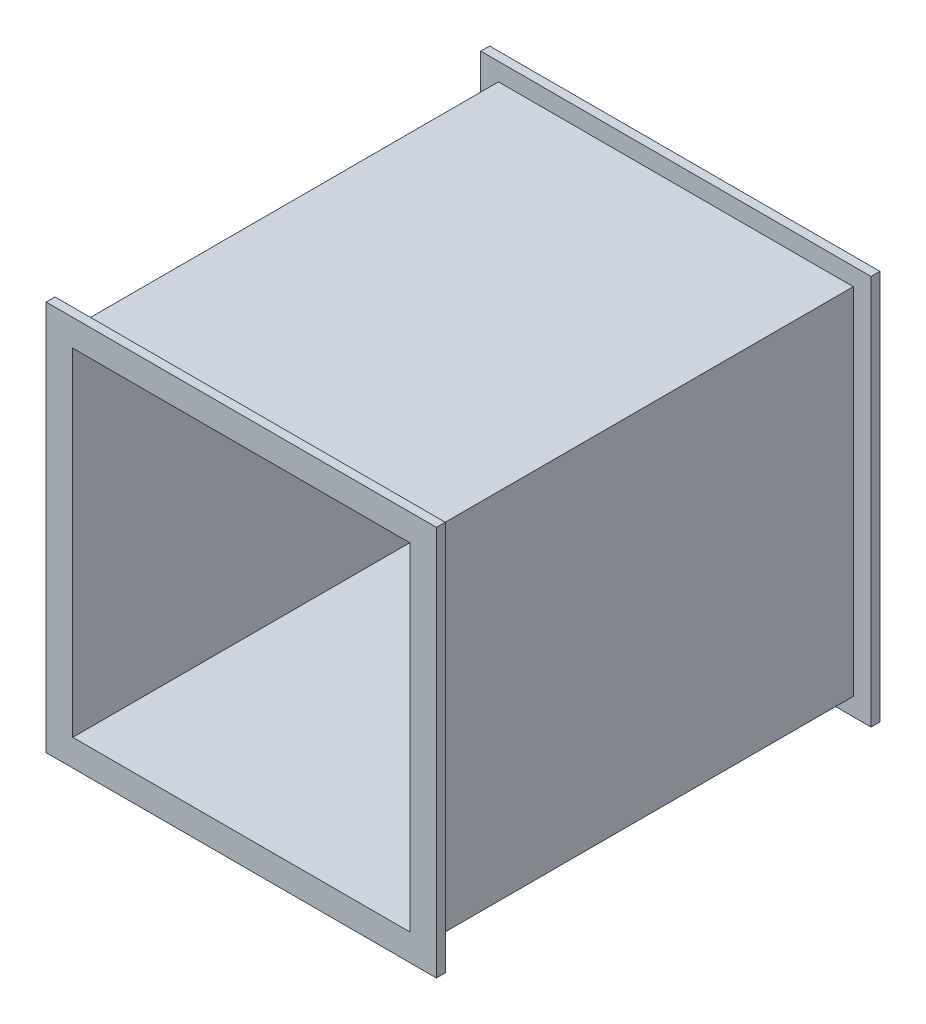
ISO-10303-21;
HEADER;
FILE_DESCRIPTION(('STEP AP214'),'2;1');
FILE_NAME('part.step','',(''),(''),'','','');
FILE_SCHEMA(('AUTOMOTIVE_DESIGN { 1 0 10303 214 1 1 1 1 }'));
ENDSEC;
DATA;
#1=APPLICATION_CONTEXT('core data for automotive mechanical design processes');
#2=APPLICATION_PROTOCOL_DEFINITION('international standard','automotive_design',2000,#1);
#3=PRODUCT_CONTEXT('',#1,'mechanical');
#4=PRODUCT('Part','Part','',(#3));
#5=PRODUCT_RELATED_PRODUCT_CATEGORY('part','',(#4));
#6=PRODUCT_DEFINITION_FORMATION('','',#4);
#7=PRODUCT_DEFINITION_CONTEXT('part definition',#1,'design');
#8=PRODUCT_DEFINITION('design','',#6,#7);
#9=PRODUCT_DEFINITION_SHAPE('','',#8);
#10=(LENGTH_UNIT() NAMED_UNIT(*) SI_UNIT(.MILLI.,.METRE.));
#11=(NAMED_UNIT(*) PLANE_ANGLE_UNIT() SI_UNIT($,.RADIAN.));
#12=(NAMED_UNIT(*) SI_UNIT($,.STERADIAN.) SOLID_ANGLE_UNIT());
#13=UNCERTAINTY_MEASURE_WITH_UNIT(LENGTH_MEASURE(1.E-05),#10,'distance_accuracy_value','');
#14=(GEOMETRIC_REPRESENTATION_CONTEXT(3) GLOBAL_UNCERTAINTY_ASSIGNED_CONTEXT((#13)) GLOBAL_UNIT_ASSIGNED_CONTEXT((#10,
#11,#12)) REPRESENTATION_CONTEXT('',''));
#15=CARTESIAN_POINT('',(0.,0.,0.));
#16=DIRECTION('',(0.,0.,1.));
#17=DIRECTION('',(1.,0.,0.));
#18=AXIS2_PLACEMENT_3D('',#15,#16,#17);
#19=CARTESIAN_POINT('',(100.,100.,250.));
#20=DIRECTION('',(-1.,0.,0.));
#21=DIRECTION('',(0.,-1.,0.));
#22=AXIS2_PLACEMENT_3D('',#19,#20,#21);
#23=PLANE('',#22);
#24=DIRECTION('',(0.,-1.,0.));
#25=VECTOR('',#24,1.);
#26=CARTESIAN_POINT('',(100.,100.,5.));
#27=LINE('',#26,#25);
#28=CARTESIAN_POINT('',(100.,100.,5.));
#29=VERTEX_POINT('',#28);
#30=CARTESIAN_POINT('',(100.,-99.9999999999999,5.));
#31=VERTEX_POINT('',#30);
#32=EDGE_CURVE('E222',#29,#31,#27,.T.);
#33=ORIENTED_EDGE('',*,*,#32,.F.);
#34=DIRECTION('',(0.,0.,-1.));
#35=VECTOR('',#34,1.);
#36=CARTESIAN_POINT('',(100.,100.,250.));
#37=LINE('',#36,#35);
#38=CARTESIAN_POINT('',(100.,100.,245.));
#39=VERTEX_POINT('',#38);
#40=EDGE_CURVE('E274',#39,#29,#37,.T.);
#41=ORIENTED_EDGE('',*,*,#40,.F.);
#42=DIRECTION('',(0.,1.,0.));
#43=VECTOR('',#42,1.);
#44=CARTESIAN_POINT('',(100.,100.,245.));
#45=LINE('',#44,#43);
#46=CARTESIAN_POINT('',(100.,-99.9999999999999,245.));
#47=VERTEX_POINT('',#46);
#48=EDGE_CURVE('E263',#47,#39,#45,.T.);
#49=ORIENTED_EDGE('',*,*,#48,.F.);
#50=DIRECTION('',(0.,0.,-1.));
#51=VECTOR('',#50,1.);
#52=CARTESIAN_POINT('',(100.,-99.9999999999999,250.));
#53=LINE('',#52,#51);
#54=EDGE_CURVE('E266',#47,#31,#53,.T.);
#55=ORIENTED_EDGE('',*,*,#54,.T.);
#56=EDGE_LOOP('',(#33,#41,#49,#55));
#57=FACE_BOUND('',#56,.T.);
#58=ADVANCED_FACE('F36',(#57),#23,.F.);
#59=CARTESIAN_POINT('',(-100.,100.,250.));
#60=DIRECTION('',(0.,-1.,0.));
#61=DIRECTION('',(0.,0.,-1.));
#62=AXIS2_PLACEMENT_3D('',#59,#60,#61);
#63=PLANE('',#62);
#64=DIRECTION('',(1.,0.,0.));
#65=VECTOR('',#64,1.);
#66=CARTESIAN_POINT('',(-100.,100.,5.));
#67=LINE('',#66,#65);
#68=CARTESIAN_POINT('',(-100.,100.,5.));
#69=VERTEX_POINT('',#68);
#70=EDGE_CURVE('E219',#69,#29,#67,.T.);
#71=ORIENTED_EDGE('',*,*,#70,.F.);
#72=DIRECTION('',(0.,0.,-1.));
#73=VECTOR('',#72,1.);
#74=CARTESIAN_POINT('',(-100.,100.,250.));
#75=LINE('',#74,#73);
#76=CARTESIAN_POINT('',(-100.,100.,245.));
#77=VERTEX_POINT('',#76);
#78=EDGE_CURVE('E271',#77,#69,#75,.T.);
#79=ORIENTED_EDGE('',*,*,#78,.F.);
#80=DIRECTION('',(-1.,0.,0.));
#81=VECTOR('',#80,1.);
#82=CARTESIAN_POINT('',(-100.,100.,245.));
#83=LINE('',#82,#81);
#84=EDGE_CURVE('E260',#39,#77,#83,.T.);
#85=ORIENTED_EDGE('',*,*,#84,.F.);
#86=ORIENTED_EDGE('',*,*,#40,.T.);
#87=EDGE_LOOP('',(#71,#79,#85,#86));
#88=FACE_BOUND('',#87,.T.);
#89=ADVANCED_FACE('F292',(#88),#63,.F.);
#90=CARTESIAN_POINT('',(-100.,100.,250.));
#91=DIRECTION('',(1.,0.,0.));
#92=DIRECTION('',(0.,1.,0.));
#93=AXIS2_PLACEMENT_3D('',#90,#91,#92);
#94=PLANE('',#93);
#95=DIRECTION('',(0.,1.,0.));
#96=VECTOR('',#95,1.);
#97=CARTESIAN_POINT('',(-100.,100.,5.));
#98=LINE('',#97,#96);
#99=CARTESIAN_POINT('',(-100.,-99.9999999999999,5.));
#100=VERTEX_POINT('',#99);
#101=EDGE_CURVE('E211',#100,#69,#98,.T.);
#102=ORIENTED_EDGE('',*,*,#101,.F.);
#103=DIRECTION('',(0.,0.,-1.));
#104=VECTOR('',#103,1.);
#105=CARTESIAN_POINT('',(-100.,-99.9999999999999,250.));
#106=LINE('',#105,#104);
#107=CARTESIAN_POINT('',(-100.,-99.9999999999999,245.));
#108=VERTEX_POINT('',#107);
#109=EDGE_CURVE('E269',#108,#100,#106,.T.);
#110=ORIENTED_EDGE('',*,*,#109,.F.);
#111=DIRECTION('',(0.,-1.,0.));
#112=VECTOR('',#111,1.);
#113=CARTESIAN_POINT('',(-100.,100.,245.));
#114=LINE('',#113,#112);
#115=EDGE_CURVE('E252',#77,#108,#114,.T.);
#116=ORIENTED_EDGE('',*,*,#115,.F.);
#117=ORIENTED_EDGE('',*,*,#78,.T.);
#118=EDGE_LOOP('',(#102,#110,#116,#117));
#119=FACE_BOUND('',#118,.T.);
#120=ADVANCED_FACE('F285',(#119),#94,.F.);
#121=CARTESIAN_POINT('',(-100.,-99.9999999999999,250.));
#122=DIRECTION('',(0.,1.,0.));
#123=DIRECTION('',(0.,0.,1.));
#124=AXIS2_PLACEMENT_3D('',#121,#122,#123);
#125=PLANE('',#124);
#126=DIRECTION('',(-1.,0.,0.));
#127=VECTOR('',#126,1.);
#128=CARTESIAN_POINT('',(-100.,-99.9999999999999,5.));
#129=LINE('',#128,#127);
#130=EDGE_CURVE('E11',#31,#100,#129,.T.);
#131=ORIENTED_EDGE('',*,*,#130,.F.);
#132=ORIENTED_EDGE('',*,*,#54,.F.);
#133=DIRECTION('',(1.,0.,0.));
#134=VECTOR('',#133,1.);
#135=CARTESIAN_POINT('',(-100.,-99.9999999999999,245.));
#136=LINE('',#135,#134);
#137=EDGE_CURVE('E43',#108,#47,#136,.T.);
#138=ORIENTED_EDGE('',*,*,#137,.F.);
#139=ORIENTED_EDGE('',*,*,#109,.T.);
#140=EDGE_LOOP('',(#131,#132,#138,#139));
#141=FACE_BOUND('',#140,.T.);
#142=ADVANCED_FACE('F282',(#141),#125,.F.);
#143=CARTESIAN_POINT('',(0.,0.,245.));
#144=DIRECTION('',(0.,0.,1.));
#145=DIRECTION('',(1.,0.,0.));
#146=AXIS2_PLACEMENT_3D('',#143,#144,#145);
#147=PLANE('',#146);
#148=DIRECTION('',(0.,1.,0.));
#149=VECTOR('',#148,1.);
#150=CARTESIAN_POINT('',(110.,-110.,245.));
#151=LINE('',#150,#149);
#152=CARTESIAN_POINT('',(110.,-110.,245.));
#153=VERTEX_POINT('',#152);
#154=CARTESIAN_POINT('',(110.,110.,245.));
#155=VERTEX_POINT('',#154);
#156=EDGE_CURVE('E226',#153,#155,#151,.T.);
#157=ORIENTED_EDGE('',*,*,#156,.F.);
#158=DIRECTION('',(1.,0.,0.));
#159=VECTOR('',#158,1.);
#160=CARTESIAN_POINT('',(-110.,-110.,245.));
#161=LINE('',#160,#159);
#162=CARTESIAN_POINT('',(-110.,-110.,245.));
#163=VERTEX_POINT('',#162);
#164=EDGE_CURVE('E236',#163,#153,#161,.T.);
#165=ORIENTED_EDGE('',*,*,#164,.F.);
#166=DIRECTION('',(0.,-1.,0.));
#167=VECTOR('',#166,1.);
#168=CARTESIAN_POINT('',(-110.,110.,245.));
#169=LINE('',#168,#167);
#170=CARTESIAN_POINT('',(-110.,110.,245.));
#171=VERTEX_POINT('',#170);
#172=EDGE_CURVE('E233',#171,#163,#169,.T.);
#173=ORIENTED_EDGE('',*,*,#172,.F.);
#174=DIRECTION('',(-1.,0.,0.));
#175=VECTOR('',#174,1.);
#176=CARTESIAN_POINT('',(110.,110.,245.));
#177=LINE('',#176,#175);
#178=EDGE_CURVE('E229',#155,#171,#177,.T.);
#179=ORIENTED_EDGE('',*,*,#178,.F.);
#180=EDGE_LOOP('',(#157,#165,#173,#179));
#181=FACE_BOUND('',#180,.T.);
#182=ORIENTED_EDGE('',*,*,#137,.T.);
#183=ORIENTED_EDGE('',*,*,#48,.T.);
#184=ORIENTED_EDGE('',*,*,#84,.T.);
#185=ORIENTED_EDGE('',*,*,#115,.T.);
#186=EDGE_LOOP('',(#182,#183,#184,#185));
#187=FACE_BOUND('',#186,.T.);
#188=ADVANCED_FACE('F278',(#181,#187),#147,.F.);
#189=CARTESIAN_POINT('',(110.,-110.,245.));
#190=DIRECTION('',(1.,0.,0.));
#191=DIRECTION('',(0.,1.,0.));
#192=AXIS2_PLACEMENT_3D('',#189,#190,#191);
#193=PLANE('',#192);
#194=DIRECTION('',(0.,1.,0.));
#195=VECTOR('',#194,1.);
#196=CARTESIAN_POINT('',(110.,-110.,250.));
#197=LINE('',#196,#195);
#198=CARTESIAN_POINT('',(110.,-110.,250.));
#199=VERTEX_POINT('',#198);
#200=CARTESIAN_POINT('',(110.,110.,250.));
#201=VERTEX_POINT('',#200);
#202=EDGE_CURVE('E225',#199,#201,#197,.T.);
#203=ORIENTED_EDGE('',*,*,#202,.F.);
#204=DIRECTION('',(0.,0.,1.));
#205=VECTOR('',#204,1.);
#206=CARTESIAN_POINT('',(110.,-110.,245.));
#207=LINE('',#206,#205);
#208=EDGE_CURVE('E250',#153,#199,#207,.T.);
#209=ORIENTED_EDGE('',*,*,#208,.F.);
#210=ORIENTED_EDGE('',*,*,#156,.T.);
#211=DIRECTION('',(0.,0.,1.));
#212=VECTOR('',#211,1.);
#213=CARTESIAN_POINT('',(110.,110.,245.));
#214=LINE('',#213,#212);
#215=EDGE_CURVE('E239',#155,#201,#214,.T.);
#216=ORIENTED_EDGE('',*,*,#215,.T.);
#217=EDGE_LOOP('',(#203,#209,#210,#216));
#218=FACE_BOUND('',#217,.T.);
#219=ADVANCED_FACE('F310',(#218),#193,.T.);
#220=CARTESIAN_POINT('',(-110.,-110.,245.));
#221=DIRECTION('',(0.,-1.,0.));
#222=DIRECTION('',(0.,0.,-1.));
#223=AXIS2_PLACEMENT_3D('',#220,#221,#222);
#224=PLANE('',#223);
#225=DIRECTION('',(1.,0.,0.));
#226=VECTOR('',#225,1.);
#227=CARTESIAN_POINT('',(-110.,-110.,250.));
#228=LINE('',#227,#226);
#229=CARTESIAN_POINT('',(-110.,-110.,250.));
#230=VERTEX_POINT('',#229);
#231=EDGE_CURVE('E230',#230,#199,#228,.T.);
#232=ORIENTED_EDGE('',*,*,#231,.F.);
#233=DIRECTION('',(0.,0.,1.));
#234=VECTOR('',#233,1.);
#235=CARTESIAN_POINT('',(-110.,-110.,245.));
#236=LINE('',#235,#234);
#237=EDGE_CURVE('E253',#163,#230,#236,.T.);
#238=ORIENTED_EDGE('',*,*,#237,.F.);
#239=ORIENTED_EDGE('',*,*,#164,.T.);
#240=ORIENTED_EDGE('',*,*,#208,.T.);
#241=EDGE_LOOP('',(#232,#238,#239,#240));
#242=FACE_BOUND('',#241,.T.);
#243=ADVANCED_FACE('F313',(#242),#224,.T.);
#244=CARTESIAN_POINT('',(-110.,110.,245.));
#245=DIRECTION('',(-1.,0.,0.));
#246=DIRECTION('',(0.,-1.,0.));
#247=AXIS2_PLACEMENT_3D('',#244,#245,#246);
#248=PLANE('',#247);
#249=DIRECTION('',(0.,-1.,0.));
#250=VECTOR('',#249,1.);
#251=CARTESIAN_POINT('',(-110.,110.,250.));
#252=LINE('',#251,#250);
#253=CARTESIAN_POINT('',(-110.,110.,250.));
#254=VERTEX_POINT('',#253);
#255=EDGE_CURVE('E245',#254,#230,#252,.T.);
#256=ORIENTED_EDGE('',*,*,#255,.F.);
#257=DIRECTION('',(0.,0.,1.));
#258=VECTOR('',#257,1.);
#259=CARTESIAN_POINT('',(-110.,110.,245.));
#260=LINE('',#259,#258);
#261=EDGE_CURVE('E255',#171,#254,#260,.T.);
#262=ORIENTED_EDGE('',*,*,#261,.F.);
#263=ORIENTED_EDGE('',*,*,#172,.T.);
#264=ORIENTED_EDGE('',*,*,#237,.T.);
#265=EDGE_LOOP('',(#256,#262,#263,#264));
#266=FACE_BOUND('',#265,.T.);
#267=ADVANCED_FACE('F317',(#266),#248,.T.);
#268=CARTESIAN_POINT('',(110.,110.,245.));
#269=DIRECTION('',(0.,1.,0.));
#270=DIRECTION('',(0.,0.,1.));
#271=AXIS2_PLACEMENT_3D('',#268,#269,#270);
#272=PLANE('',#271);
#273=DIRECTION('',(-1.,0.,0.));
#274=VECTOR('',#273,1.);
#275=CARTESIAN_POINT('',(110.,110.,250.));
#276=LINE('',#275,#274);
#277=EDGE_CURVE('E242',#201,#254,#276,.T.);
#278=ORIENTED_EDGE('',*,*,#277,.F.);
#279=ORIENTED_EDGE('',*,*,#215,.F.);
#280=ORIENTED_EDGE('',*,*,#178,.T.);
#281=ORIENTED_EDGE('',*,*,#261,.T.);
#282=EDGE_LOOP('',(#278,#279,#280,#281));
#283=FACE_BOUND('',#282,.T.);
#284=ADVANCED_FACE('F308',(#283),#272,.T.);
#285=CARTESIAN_POINT('',(0.,0.,250.));
#286=DIRECTION('',(0.,0.,1.));
#287=DIRECTION('',(1.,0.,0.));
#288=AXIS2_PLACEMENT_3D('',#285,#286,#287);
#289=PLANE('',#288);
#290=DIRECTION('',(0.,1.,0.));
#291=VECTOR('',#290,1.);
#292=CARTESIAN_POINT('',(95.,-95.,250.));
#293=LINE('',#292,#291);
#294=CARTESIAN_POINT('',(95.,-95.,250.));
#295=VERTEX_POINT('',#294);
#296=CARTESIAN_POINT('',(95.,95.,250.));
#297=VERTEX_POINT('',#296);
#298=EDGE_CURVE('E50',#295,#297,#293,.T.);
#299=ORIENTED_EDGE('',*,*,#298,.F.);
#300=DIRECTION('',(1.,0.,0.));
#301=VECTOR('',#300,1.);
#302=CARTESIAN_POINT('',(-95.,-95.,250.));
#303=LINE('',#302,#301);
#304=CARTESIAN_POINT('',(-95.,-95.,250.));
#305=VERTEX_POINT('',#304);
#306=EDGE_CURVE('E166',#305,#295,#303,.T.);
#307=ORIENTED_EDGE('',*,*,#306,.F.);
#308=DIRECTION('',(0.,-1.,0.));
#309=VECTOR('',#308,1.);
#310=CARTESIAN_POINT('',(-95.,-95.,250.));
#311=LINE('',#310,#309);
#312=CARTESIAN_POINT('',(-95.,95.,250.));
#313=VERTEX_POINT('',#312);
#314=EDGE_CURVE('E169',#313,#305,#311,.T.);
#315=ORIENTED_EDGE('',*,*,#314,.F.);
#316=DIRECTION('',(-1.,0.,0.));
#317=VECTOR('',#316,1.);
#318=CARTESIAN_POINT('',(-95.,95.,250.));
#319=LINE('',#318,#317);
#320=EDGE_CURVE('E175',#297,#313,#319,.T.);
#321=ORIENTED_EDGE('',*,*,#320,.F.);
#322=EDGE_LOOP('',(#299,#307,#315,#321));
#323=FACE_BOUND('',#322,.T.);
#324=ORIENTED_EDGE('',*,*,#202,.T.);
#325=ORIENTED_EDGE('',*,*,#277,.T.);
#326=ORIENTED_EDGE('',*,*,#255,.T.);
#327=ORIENTED_EDGE('',*,*,#231,.T.);
#328=EDGE_LOOP('',(#324,#325,#326,#327));
#329=FACE_BOUND('',#328,.T.);
#330=ADVANCED_FACE('F305',(#323,#329),#289,.T.);
#331=CARTESIAN_POINT('',(0.,0.,5.));
#332=DIRECTION('',(0.,0.,-1.));
#333=DIRECTION('',(-1.,0.,0.));
#334=AXIS2_PLACEMENT_3D('',#331,#332,#333);
#335=PLANE('',#334);
#336=DIRECTION('',(1.,0.,0.));
#337=VECTOR('',#336,1.);
#338=CARTESIAN_POINT('',(-110.,110.,5.));
#339=LINE('',#338,#337);
#340=CARTESIAN_POINT('',(-110.,110.,5.));
#341=VERTEX_POINT('',#340);
#342=CARTESIAN_POINT('',(110.,110.,5.));
#343=VERTEX_POINT('',#342);
#344=EDGE_CURVE('E185',#341,#343,#339,.T.);
#345=ORIENTED_EDGE('',*,*,#344,.F.);
#346=DIRECTION('',(0.,1.,0.));
#347=VECTOR('',#346,1.);
#348=CARTESIAN_POINT('',(-110.,-110.,5.));
#349=LINE('',#348,#347);
#350=CARTESIAN_POINT('',(-110.,-110.,5.));
#351=VERTEX_POINT('',#350);
#352=EDGE_CURVE('E195',#351,#341,#349,.T.);
#353=ORIENTED_EDGE('',*,*,#352,.F.);
#354=DIRECTION('',(-1.,0.,0.));
#355=VECTOR('',#354,1.);
#356=CARTESIAN_POINT('',(110.,-110.,5.));
#357=LINE('',#356,#355);
#358=CARTESIAN_POINT('',(110.,-110.,5.));
#359=VERTEX_POINT('',#358);
#360=EDGE_CURVE('E192',#359,#351,#357,.T.);
#361=ORIENTED_EDGE('',*,*,#360,.F.);
#362=DIRECTION('',(0.,-1.,0.));
#363=VECTOR('',#362,1.);
#364=CARTESIAN_POINT('',(110.,110.,5.));
#365=LINE('',#364,#363);
#366=EDGE_CURVE('E188',#343,#359,#365,.T.);
#367=ORIENTED_EDGE('',*,*,#366,.F.);
#368=EDGE_LOOP('',(#345,#353,#361,#367));
#369=FACE_BOUND('',#368,.T.);
#370=ORIENTED_EDGE('',*,*,#70,.T.);
#371=ORIENTED_EDGE('',*,*,#32,.T.);
#372=ORIENTED_EDGE('',*,*,#130,.T.);
#373=ORIENTED_EDGE('',*,*,#101,.T.);
#374=EDGE_LOOP('',(#370,#371,#372,#373));
#375=FACE_BOUND('',#374,.T.);
#376=ADVANCED_FACE('F288',(#369,#375),#335,.F.);
#377=CARTESIAN_POINT('',(-110.,110.,5.));
#378=DIRECTION('',(0.,1.,0.));
#379=DIRECTION('',(0.,0.,1.));
#380=AXIS2_PLACEMENT_3D('',#377,#378,#379);
#381=PLANE('',#380);
#382=DIRECTION('',(1.,0.,0.));
#383=VECTOR('',#382,1.);
#384=CARTESIAN_POINT('',(-110.,110.,0.));
#385=LINE('',#384,#383);
#386=CARTESIAN_POINT('',(-110.,110.,0.));
#387=VERTEX_POINT('',#386);
#388=CARTESIAN_POINT('',(110.,110.,0.));
#389=VERTEX_POINT('',#388);
#390=EDGE_CURVE('E181',#387,#389,#385,.T.);
#391=ORIENTED_EDGE('',*,*,#390,.F.);
#392=DIRECTION('',(0.,0.,-1.));
#393=VECTOR('',#392,1.);
#394=CARTESIAN_POINT('',(-110.,110.,5.));
#395=LINE('',#394,#393);
#396=EDGE_CURVE('E209',#341,#387,#395,.T.);
#397=ORIENTED_EDGE('',*,*,#396,.F.);
#398=ORIENTED_EDGE('',*,*,#344,.T.);
#399=DIRECTION('',(0.,0.,-1.));
#400=VECTOR('',#399,1.);
#401=CARTESIAN_POINT('',(110.,110.,5.));
#402=LINE('',#401,#400);
#403=EDGE_CURVE('E198',#343,#389,#402,.T.);
#404=ORIENTED_EDGE('',*,*,#403,.T.);
#405=EDGE_LOOP('',(#391,#397,#398,#404));
#406=FACE_BOUND('',#405,.T.);
#407=ADVANCED_FACE('F328',(#406),#381,.T.);
#408=CARTESIAN_POINT('',(-110.,-110.,5.));
#409=DIRECTION('',(-1.,0.,0.));
#410=DIRECTION('',(0.,-1.,0.));
#411=AXIS2_PLACEMENT_3D('',#408,#409,#410);
#412=PLANE('',#411);
#413=DIRECTION('',(0.,1.,0.));
#414=VECTOR('',#413,1.);
#415=CARTESIAN_POINT('',(-110.,-110.,0.));
#416=LINE('',#415,#414);
#417=CARTESIAN_POINT('',(-110.,-110.,0.));
#418=VERTEX_POINT('',#417);
#419=EDGE_CURVE('E189',#418,#387,#416,.T.);
#420=ORIENTED_EDGE('',*,*,#419,.F.);
#421=DIRECTION('',(0.,0.,-1.));
#422=VECTOR('',#421,1.);
#423=CARTESIAN_POINT('',(-110.,-110.,5.));
#424=LINE('',#423,#422);
#425=EDGE_CURVE('E212',#351,#418,#424,.T.);
#426=ORIENTED_EDGE('',*,*,#425,.F.);
#427=ORIENTED_EDGE('',*,*,#352,.T.);
#428=ORIENTED_EDGE('',*,*,#396,.T.);
#429=EDGE_LOOP('',(#420,#426,#427,#428));
#430=FACE_BOUND('',#429,.T.);
#431=ADVANCED_FACE('F331',(#430),#412,.T.);
#432=CARTESIAN_POINT('',(110.,-110.,5.));
#433=DIRECTION('',(0.,-1.,0.));
#434=DIRECTION('',(0.,0.,-1.));
#435=AXIS2_PLACEMENT_3D('',#432,#433,#434);
#436=PLANE('',#435);
#437=DIRECTION('',(-1.,0.,0.));
#438=VECTOR('',#437,1.);
#439=CARTESIAN_POINT('',(110.,-110.,0.));
#440=LINE('',#439,#438);
#441=CARTESIAN_POINT('',(110.,-110.,0.));
#442=VERTEX_POINT('',#441);
#443=EDGE_CURVE('E204',#442,#418,#440,.T.);
#444=ORIENTED_EDGE('',*,*,#443,.F.);
#445=DIRECTION('',(0.,0.,-1.));
#446=VECTOR('',#445,1.);
#447=CARTESIAN_POINT('',(110.,-110.,5.));
#448=LINE('',#447,#446);
#449=EDGE_CURVE('E214',#359,#442,#448,.T.);
#450=ORIENTED_EDGE('',*,*,#449,.F.);
#451=ORIENTED_EDGE('',*,*,#360,.T.);
#452=ORIENTED_EDGE('',*,*,#425,.T.);
#453=EDGE_LOOP('',(#444,#450,#451,#452));
#454=FACE_BOUND('',#453,.T.);
#455=ADVANCED_FACE('F335',(#454),#436,.T.);
#456=CARTESIAN_POINT('',(110.,110.,5.));
#457=DIRECTION('',(1.,0.,0.));
#458=DIRECTION('',(0.,1.,0.));
#459=AXIS2_PLACEMENT_3D('',#456,#457,#458);
#460=PLANE('',#459);
#461=DIRECTION('',(0.,-1.,0.));
#462=VECTOR('',#461,1.);
#463=CARTESIAN_POINT('',(110.,110.,0.));
#464=LINE('',#463,#462);
#465=EDGE_CURVE('E201',#389,#442,#464,.T.);
#466=ORIENTED_EDGE('',*,*,#465,.F.);
#467=ORIENTED_EDGE('',*,*,#403,.F.);
#468=ORIENTED_EDGE('',*,*,#366,.T.);
#469=ORIENTED_EDGE('',*,*,#449,.T.);
#470=EDGE_LOOP('',(#466,#467,#468,#469));
#471=FACE_BOUND('',#470,.T.);
#472=ADVANCED_FACE('F304',(#471),#460,.T.);
#473=CARTESIAN_POINT('',(0.,0.,0.));
#474=DIRECTION('',(0.,0.,1.));
#475=DIRECTION('',(1.,0.,0.));
#476=AXIS2_PLACEMENT_3D('',#473,#474,#475);
#477=PLANE('',#476);
#478=DIRECTION('',(1.,0.,0.));
#479=VECTOR('',#478,1.);
#480=CARTESIAN_POINT('',(-95.,-95.,0.));
#481=LINE('',#480,#479);
#482=CARTESIAN_POINT('',(-95.,-95.,0.));
#483=VERTEX_POINT('',#482);
#484=CARTESIAN_POINT('',(95.,-95.,0.));
#485=VERTEX_POINT('',#484);
#486=EDGE_CURVE('E156',#483,#485,#481,.T.);
#487=ORIENTED_EDGE('',*,*,#486,.T.);
#488=DIRECTION('',(0.,1.,0.));
#489=VECTOR('',#488,1.);
#490=CARTESIAN_POINT('',(95.,-95.,0.));
#491=LINE('',#490,#489);
#492=CARTESIAN_POINT('',(95.,95.,0.));
#493=VERTEX_POINT('',#492);
#494=EDGE_CURVE('E150',#485,#493,#491,.T.);
#495=ORIENTED_EDGE('',*,*,#494,.T.);
#496=DIRECTION('',(-1.,0.,0.));
#497=VECTOR('',#496,1.);
#498=CARTESIAN_POINT('',(-95.,95.,0.));
#499=LINE('',#498,#497);
#500=CARTESIAN_POINT('',(-95.,95.,0.));
#501=VERTEX_POINT('',#500);
#502=EDGE_CURVE('E159',#493,#501,#499,.T.);
#503=ORIENTED_EDGE('',*,*,#502,.T.);
#504=DIRECTION('',(0.,-1.,0.));
#505=VECTOR('',#504,1.);
#506=CARTESIAN_POINT('',(-95.,-95.,0.));
#507=LINE('',#506,#505);
#508=EDGE_CURVE('E58',#501,#483,#507,.T.);
#509=ORIENTED_EDGE('',*,*,#508,.T.);
#510=EDGE_LOOP('',(#487,#495,#503,#509));
#511=FACE_BOUND('',#510,.T.);
#512=ORIENTED_EDGE('',*,*,#390,.T.);
#513=ORIENTED_EDGE('',*,*,#465,.T.);
#514=ORIENTED_EDGE('',*,*,#443,.T.);
#515=ORIENTED_EDGE('',*,*,#419,.T.);
#516=EDGE_LOOP('',(#512,#513,#514,#515));
#517=FACE_BOUND('',#516,.T.);
#518=ADVANCED_FACE('F163',(#511,#517),#477,.F.);
#519=CARTESIAN_POINT('',(95.,-95.,0.));
#520=DIRECTION('',(1.,0.,0.));
#521=DIRECTION('',(0.,0.,-1.));
#522=AXIS2_PLACEMENT_3D('',#519,#520,#521);
#523=PLANE('',#522);
#524=ORIENTED_EDGE('',*,*,#298,.T.);
#525=DIRECTION('',(0.,0.,1.));
#526=VECTOR('',#525,1.);
#527=CARTESIAN_POINT('',(95.,95.,0.));
#528=LINE('',#527,#526);
#529=EDGE_CURVE('E146',#493,#297,#528,.T.);
#530=ORIENTED_EDGE('',*,*,#529,.F.);
#531=ORIENTED_EDGE('',*,*,#494,.F.);
#532=DIRECTION('',(0.,0.,1.));
#533=VECTOR('',#532,1.);
#534=CARTESIAN_POINT('',(95.,-95.,0.));
#535=LINE('',#534,#533);
#536=EDGE_CURVE('E179',#485,#295,#535,.T.);
#537=ORIENTED_EDGE('',*,*,#536,.T.);
#538=EDGE_LOOP('',(#524,#530,#531,#537));
#539=FACE_BOUND('',#538,.T.);
#540=ADVANCED_FACE('F148',(#539),#523,.F.);
#541=CARTESIAN_POINT('',(-95.,-95.,0.));
#542=DIRECTION('',(0.,-1.,0.));
#543=DIRECTION('',(0.,0.,-1.));
#544=AXIS2_PLACEMENT_3D('',#541,#542,#543);
#545=PLANE('',#544);
#546=ORIENTED_EDGE('',*,*,#306,.T.);
#547=ORIENTED_EDGE('',*,*,#536,.F.);
#548=ORIENTED_EDGE('',*,*,#486,.F.);
#549=DIRECTION('',(0.,0.,1.));
#550=VECTOR('',#549,1.);
#551=CARTESIAN_POINT('',(-95.,-95.,0.));
#552=LINE('',#551,#550);
#553=EDGE_CURVE('E182',#483,#305,#552,.T.);
#554=ORIENTED_EDGE('',*,*,#553,.T.);
#555=EDGE_LOOP('',(#546,#547,#548,#554));
#556=FACE_BOUND('',#555,.T.);
#557=ADVANCED_FACE('F348',(#556),#545,.F.);
#558=CARTESIAN_POINT('',(-95.,-95.,0.));
#559=DIRECTION('',(-1.,0.,0.));
#560=DIRECTION('',(0.,0.,1.));
#561=AXIS2_PLACEMENT_3D('',#558,#559,#560);
#562=PLANE('',#561);
#563=ORIENTED_EDGE('',*,*,#314,.T.);
#564=ORIENTED_EDGE('',*,*,#553,.F.);
#565=ORIENTED_EDGE('',*,*,#508,.F.);
#566=DIRECTION('',(0.,0.,1.));
#567=VECTOR('',#566,1.);
#568=CARTESIAN_POINT('',(-95.,95.,0.));
#569=LINE('',#568,#567);
#570=EDGE_CURVE('E155',#501,#313,#569,.T.);
#571=ORIENTED_EDGE('',*,*,#570,.T.);
#572=EDGE_LOOP('',(#563,#564,#565,#571));
#573=FACE_BOUND('',#572,.T.);
#574=ADVANCED_FACE('F351',(#573),#562,.F.);
#575=CARTESIAN_POINT('',(-95.,95.,0.));
#576=DIRECTION('',(0.,1.,0.));
#577=DIRECTION('',(0.,0.,1.));
#578=AXIS2_PLACEMENT_3D('',#575,#576,#577);
#579=PLANE('',#578);
#580=ORIENTED_EDGE('',*,*,#320,.T.);
#581=ORIENTED_EDGE('',*,*,#570,.F.);
#582=ORIENTED_EDGE('',*,*,#502,.F.);
#583=ORIENTED_EDGE('',*,*,#529,.T.);
#584=EDGE_LOOP('',(#580,#581,#582,#583));
#585=FACE_BOUND('',#584,.T.);
#586=ADVANCED_FACE('F160',(#585),#579,.F.);
#587=CLOSED_SHELL('',(#58,#89,#120,#142,#188,#219,#243,#267,#284,#330,#376,#407,#431,#455,#472,
#518,#540,#557,#574,#586));
#588=MANIFOLD_SOLID_BREP('B2',#587);
#589=ADVANCED_BREP_SHAPE_REPRESENTATION('',(#18,#588),#14);
#590=SHAPE_DEFINITION_REPRESENTATION(#9,#589);
ENDSEC;
END-ISO-10303-21;
